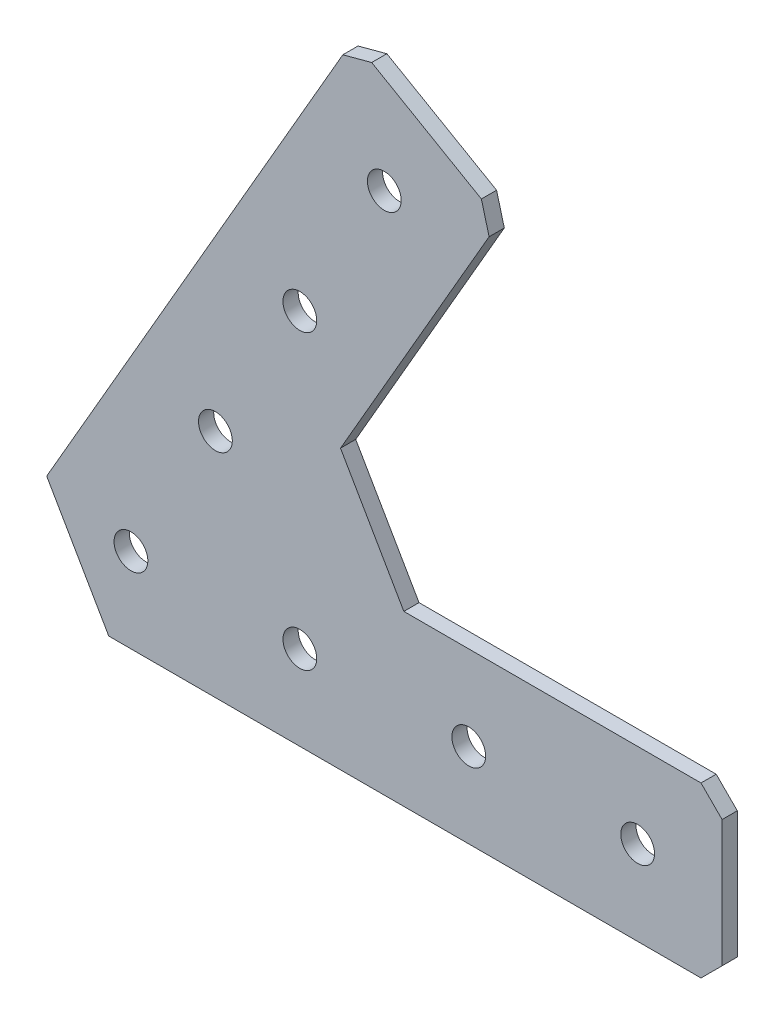
ISO-10303-21;
HEADER;
FILE_DESCRIPTION(('STEP AP214'),'2;1');
FILE_NAME('part.step','',(''),(''),'','','');
FILE_SCHEMA(('AUTOMOTIVE_DESIGN { 1 0 10303 214 1 1 1 1 }'));
ENDSEC;
DATA;
#1=APPLICATION_CONTEXT('core data for automotive mechanical design processes');
#2=APPLICATION_PROTOCOL_DEFINITION('international standard','automotive_design',2000,#1);
#3=PRODUCT_CONTEXT('',#1,'mechanical');
#4=PRODUCT('Part','Part','',(#3));
#5=PRODUCT_RELATED_PRODUCT_CATEGORY('part','',(#4));
#6=PRODUCT_DEFINITION_FORMATION('','',#4);
#7=PRODUCT_DEFINITION_CONTEXT('part definition',#1,'design');
#8=PRODUCT_DEFINITION('design','',#6,#7);
#9=PRODUCT_DEFINITION_SHAPE('','',#8);
#10=(LENGTH_UNIT() NAMED_UNIT(*) SI_UNIT(.MILLI.,.METRE.));
#11=(NAMED_UNIT(*) PLANE_ANGLE_UNIT() SI_UNIT($,.RADIAN.));
#12=(NAMED_UNIT(*) SI_UNIT($,.STERADIAN.) SOLID_ANGLE_UNIT());
#13=UNCERTAINTY_MEASURE_WITH_UNIT(LENGTH_MEASURE(1.E-05),#10,'distance_accuracy_value','');
#14=(GEOMETRIC_REPRESENTATION_CONTEXT(3) GLOBAL_UNCERTAINTY_ASSIGNED_CONTEXT((#13)) GLOBAL_UNIT_ASSIGNED_CONTEXT((#10,
#11,#12)) REPRESENTATION_CONTEXT('',''));
#15=CARTESIAN_POINT('',(0.,0.,0.));
#16=DIRECTION('',(0.,0.,1.));
#17=DIRECTION('',(1.,0.,0.));
#18=AXIS2_PLACEMENT_3D('',#15,#16,#17);
#19=CARTESIAN_POINT('',(0.,0.,-2.032));
#20=DIRECTION('',(0.,0.,-1.));
#21=DIRECTION('',(-1.,0.,0.));
#22=AXIS2_PLACEMENT_3D('',#19,#20,#21);
#23=PLANE('',#22);
#24=DIRECTION('',(-1.,0.,0.));
#25=VECTOR('',#24,1.);
#26=CARTESIAN_POINT('',(0.258928574833119,12.7,-2.032));
#27=LINE('',#26,#25);
#28=CARTESIAN_POINT('',(44.9454651,12.7,-2.032));
#29=VERTEX_POINT('',#28);
#30=CARTESIAN_POINT('',(0.258928574833118,12.7,-2.032));
#31=VERTEX_POINT('',#30);
#32=EDGE_CURVE('E444',#29,#31,#27,.T.);
#33=ORIENTED_EDGE('',*,*,#32,.F.);
#34=DIRECTION('',(-0.70710678118655,0.707106781186545,0.));
#35=VECTOR('',#34,1.);
#36=CARTESIAN_POINT('',(44.9454651,12.7,-2.032));
#37=LINE('',#36,#35);
#38=CARTESIAN_POINT('',(48.1204651,9.525,-2.032));
#39=VERTEX_POINT('',#38);
#40=EDGE_CURVE('E440',#39,#29,#37,.T.);
#41=ORIENTED_EDGE('',*,*,#40,.F.);
#42=DIRECTION('',(0.,1.,0.));
#43=VECTOR('',#42,1.);
#44=CARTESIAN_POINT('',(48.1204651,9.525,-2.032));
#45=LINE('',#44,#43);
#46=CARTESIAN_POINT('',(48.1204651,-9.52500000000001,-2.032));
#47=VERTEX_POINT('',#46);
#48=EDGE_CURVE('E123',#47,#39,#45,.T.);
#49=ORIENTED_EDGE('',*,*,#48,.F.);
#50=DIRECTION('',(0.707106781186548,0.707106781186548,0.));
#51=VECTOR('',#50,1.);
#52=CARTESIAN_POINT('',(48.1204651,-9.52500000000002,-2.032));
#53=LINE('',#52,#51);
#54=CARTESIAN_POINT('',(44.9454651,-12.7,-2.032));
#55=VERTEX_POINT('',#54);
#56=EDGE_CURVE('E117',#55,#47,#53,.T.);
#57=ORIENTED_EDGE('',*,*,#56,.F.);
#58=DIRECTION('',(1.,0.,0.));
#59=VECTOR('',#58,1.);
#60=CARTESIAN_POINT('',(44.9454651,-12.7,-2.032));
#61=LINE('',#60,#59);
#62=CARTESIAN_POINT('',(-44.1161619374166,-12.7,-2.032));
#63=VERTEX_POINT('',#62);
#64=EDGE_CURVE('E108',#63,#55,#61,.T.);
#65=ORIENTED_EDGE('',*,*,#64,.F.);
#66=DIRECTION('',(0.500000000000001,-0.866025403784438,0.));
#67=VECTOR('',#66,1.);
#68=CARTESIAN_POINT('',(-44.1161619374166,-12.7,-2.032));
#69=LINE('',#68,#67);
#70=CARTESIAN_POINT('',(-53.4506619374166,3.46782826325159,-2.032));
#71=VERTEX_POINT('',#70);
#72=EDGE_CURVE('E103',#71,#63,#69,.T.);
#73=ORIENTED_EDGE('',*,*,#72,.F.);
#74=DIRECTION('',(-0.500000000000004,-0.866025403784436,0.));
#75=VECTOR('',#74,1.);
#76=CARTESIAN_POINT('',(-53.4506619374166,3.46782826325159,-2.032));
#77=LINE('',#76,#75);
#78=CARTESIAN_POINT('',(-8.91556509999972,80.6048787056569,-2.032));
#79=VERTEX_POINT('',#78);
#80=EDGE_CURVE('E467',#79,#71,#77,.T.);
#81=ORIENTED_EDGE('',*,*,#80,.F.);
#82=DIRECTION('',(-0.965925826289069,-0.258819045102519,0.));
#83=VECTOR('',#82,1.);
#84=CARTESIAN_POINT('',(-8.91556509999973,80.6048787056569,-2.032));
#85=LINE('',#84,#83);
#86=CARTESIAN_POINT('',(-4.57843444298411,81.7670093626725,-2.032));
#87=VERTEX_POINT('',#86);
#88=EDGE_CURVE('E464',#87,#79,#85,.T.);
#89=ORIENTED_EDGE('',*,*,#88,.F.);
#90=DIRECTION('',(-0.866025403784437,0.500000000000003,0.));
#91=VECTOR('',#90,1.);
#92=CARTESIAN_POINT('',(-4.57843444298411,81.7670093626725,-2.032));
#93=LINE('',#92,#91);
#94=CARTESIAN_POINT('',(11.9193494991094,72.2420093626724,-2.032));
#95=VERTEX_POINT('',#94);
#96=EDGE_CURVE('E460',#95,#87,#93,.T.);
#97=ORIENTED_EDGE('',*,*,#96,.F.);
#98=DIRECTION('',(-0.258819045102517,0.965925826289069,0.));
#99=VECTOR('',#98,1.);
#100=CARTESIAN_POINT('',(11.9193494991094,72.2420093626724,-2.032));
#101=LINE('',#100,#99);
#102=CARTESIAN_POINT('',(13.081480156125,67.9048787056568,-2.032));
#103=VERTEX_POINT('',#102);
#104=EDGE_CURVE('E456',#103,#95,#101,.T.);
#105=ORIENTED_EDGE('',*,*,#104,.F.);
#106=DIRECTION('',(0.500000000000004,0.866025403784436,0.));
#107=VECTOR('',#106,1.);
#108=CARTESIAN_POINT('',(13.081480156125,67.9048787056568,-2.032));
#109=LINE('',#108,#107);
#110=CARTESIAN_POINT('',(-9.26607142516689,29.1977839420935,-2.032));
#111=VERTEX_POINT('',#110);
#112=EDGE_CURVE('E452',#111,#103,#109,.T.);
#113=ORIENTED_EDGE('',*,*,#112,.F.);
#114=DIRECTION('',(-0.500000000000002,0.866025403784438,0.));
#115=VECTOR('',#114,1.);
#116=CARTESIAN_POINT('',(-9.26607142516689,29.1977839420935,-2.032));
#117=LINE('',#116,#115);
#118=EDGE_CURVE('E448',#31,#111,#117,.T.);
#119=ORIENTED_EDGE('',*,*,#118,.F.);
#120=EDGE_LOOP('',(#33,#41,#49,#57,#65,#73,#81,#89,#97,#105,#113,#119));
#121=FACE_BOUND('',#120,.T.);
#122=CARTESIAN_POINT('',(-2.67954247193765,66.0059867346102,-2.032));
#123=DIRECTION('',(0.,0.,-1.));
#124=DIRECTION('',(-1.,0.,0.));
#125=AXIS2_PLACEMENT_3D('',#122,#123,#124);
#126=CIRCLE('',#125,2.53999999999999);
#127=CARTESIAN_POINT('',(-5.21954247193763,66.0059867346102,-2.032));
#128=VERTEX_POINT('',#127);
#129=EDGE_CURVE('E127',#128,#128,#126,.F.);
#130=ORIENTED_EDGE('',*,*,#129,.T.);
#131=EDGE_LOOP('',(#130));
#132=FACE_BOUND('',#131,.T.);
#133=CARTESIAN_POINT('',(-15.3795424719377,44.0089414784855,-2.032));
#134=DIRECTION('',(0.,0.,-1.));
#135=DIRECTION('',(-1.,0.,0.));
#136=AXIS2_PLACEMENT_3D('',#133,#134,#135);
#137=CIRCLE('',#136,2.53999999999999);
#138=CARTESIAN_POINT('',(-17.9195424719377,44.0089414784855,-2.032));
#139=VERTEX_POINT('',#138);
#140=EDGE_CURVE('E160',#139,#139,#137,.F.);
#141=ORIENTED_EDGE('',*,*,#140,.T.);
#142=EDGE_LOOP('',(#141));
#143=FACE_BOUND('',#142,.T.);
#144=CARTESIAN_POINT('',(-28.0795424719378,22.0118962223608,-2.032));
#145=DIRECTION('',(0.,0.,-1.));
#146=DIRECTION('',(-1.,0.,0.));
#147=AXIS2_PLACEMENT_3D('',#144,#145,#146);
#148=CIRCLE('',#147,2.53999999999999);
#149=CARTESIAN_POINT('',(-30.6195424719378,22.0118962223608,-2.032));
#150=VERTEX_POINT('',#149);
#151=EDGE_CURVE('E163',#150,#150,#148,.F.);
#152=ORIENTED_EDGE('',*,*,#151,.T.);
#153=EDGE_LOOP('',(#152));
#154=FACE_BOUND('',#153,.T.);
#155=CARTESIAN_POINT('',(-40.7795424719379,0.0148509662361157,-2.032));
#156=DIRECTION('',(0.,0.,-1.));
#157=DIRECTION('',(-1.,0.,0.));
#158=AXIS2_PLACEMENT_3D('',#155,#156,#157);
#159=CIRCLE('',#158,2.53999999999999);
#160=CARTESIAN_POINT('',(-43.3195424719379,0.0148509662361157,-2.032));
#161=VERTEX_POINT('',#160);
#162=EDGE_CURVE('E166',#161,#161,#159,.F.);
#163=ORIENTED_EDGE('',*,*,#162,.T.);
#164=EDGE_LOOP('',(#163));
#165=FACE_BOUND('',#164,.T.);
#166=CARTESIAN_POINT('',(35.4204651,0.,-2.032));
#167=DIRECTION('',(0.,0.,-1.));
#168=DIRECTION('',(-1.,0.,0.));
#169=AXIS2_PLACEMENT_3D('',#166,#167,#168);
#170=CIRCLE('',#169,2.54);
#171=CARTESIAN_POINT('',(32.8804651,0.,-2.032));
#172=VERTEX_POINT('',#171);
#173=EDGE_CURVE('E169',#172,#172,#170,.F.);
#174=ORIENTED_EDGE('',*,*,#173,.T.);
#175=EDGE_LOOP('',(#174));
#176=FACE_BOUND('',#175,.T.);
#177=CARTESIAN_POINT('',(10.0204651,0.,-2.032));
#178=DIRECTION('',(0.,0.,-1.));
#179=DIRECTION('',(-1.,0.,0.));
#180=AXIS2_PLACEMENT_3D('',#177,#178,#179);
#181=CIRCLE('',#180,2.54);
#182=CARTESIAN_POINT('',(7.48046509999999,0.,-2.032));
#183=VERTEX_POINT('',#182);
#184=EDGE_CURVE('E171',#183,#183,#181,.F.);
#185=ORIENTED_EDGE('',*,*,#184,.T.);
#186=EDGE_LOOP('',(#185));
#187=FACE_BOUND('',#186,.T.);
#188=CARTESIAN_POINT('',(-15.3795349,0.,-2.032));
#189=DIRECTION('',(0.,0.,-1.));
#190=DIRECTION('',(-1.,0.,0.));
#191=AXIS2_PLACEMENT_3D('',#188,#189,#190);
#192=CIRCLE('',#191,2.54);
#193=CARTESIAN_POINT('',(-17.9195349,0.,-2.032));
#194=VERTEX_POINT('',#193);
#195=EDGE_CURVE('E21',#194,#194,#192,.F.);
#196=ORIENTED_EDGE('',*,*,#195,.T.);
#197=EDGE_LOOP('',(#196));
#198=FACE_BOUND('',#197,.T.);
#199=ADVANCED_FACE('F18',(#121,#132,#143,#154,#165,#176,#187,#198),#23,.T.);
#200=CARTESIAN_POINT('',(-15.3795349,0.,0.254));
#201=DIRECTION('',(0.,0.,-1.));
#202=DIRECTION('',(-1.,0.,0.));
#203=AXIS2_PLACEMENT_3D('',#200,#201,#202);
#204=CYLINDRICAL_SURFACE('',#203,2.54);
#205=CARTESIAN_POINT('',(-15.3795349,0.,0.254));
#206=DIRECTION('',(0.,0.,-1.));
#207=DIRECTION('',(-1.,0.,0.));
#208=AXIS2_PLACEMENT_3D('',#205,#206,#207);
#209=CIRCLE('',#208,2.54);
#210=CARTESIAN_POINT('',(-17.9195349,0.,0.254));
#211=VERTEX_POINT('',#210);
#212=EDGE_CURVE('E154',#211,#211,#209,.F.);
#213=ORIENTED_EDGE('',*,*,#212,.T.);
#214=EDGE_LOOP('',(#213));
#215=FACE_BOUND('',#214,.T.);
#216=ORIENTED_EDGE('',*,*,#195,.F.);
#217=EDGE_LOOP('',(#216));
#218=FACE_BOUND('',#217,.T.);
#219=ADVANCED_FACE('F179',(#215,#218),#204,.F.);
#220=CARTESIAN_POINT('',(10.0204651,0.,0.254));
#221=DIRECTION('',(0.,0.,-1.));
#222=DIRECTION('',(-1.,0.,0.));
#223=AXIS2_PLACEMENT_3D('',#220,#221,#222);
#224=CYLINDRICAL_SURFACE('',#223,2.54);
#225=CARTESIAN_POINT('',(10.0204651,0.,0.254));
#226=DIRECTION('',(0.,0.,-1.));
#227=DIRECTION('',(-1.,0.,0.));
#228=AXIS2_PLACEMENT_3D('',#225,#226,#227);
#229=CIRCLE('',#228,2.54);
#230=CARTESIAN_POINT('',(7.48046509999999,0.,0.254));
#231=VERTEX_POINT('',#230);
#232=EDGE_CURVE('E151',#231,#231,#229,.F.);
#233=ORIENTED_EDGE('',*,*,#232,.T.);
#234=EDGE_LOOP('',(#233));
#235=FACE_BOUND('',#234,.T.);
#236=ORIENTED_EDGE('',*,*,#184,.F.);
#237=EDGE_LOOP('',(#236));
#238=FACE_BOUND('',#237,.T.);
#239=ADVANCED_FACE('F181',(#235,#238),#224,.F.);
#240=CARTESIAN_POINT('',(35.4204651,0.,0.254));
#241=DIRECTION('',(0.,0.,-1.));
#242=DIRECTION('',(-1.,0.,0.));
#243=AXIS2_PLACEMENT_3D('',#240,#241,#242);
#244=CYLINDRICAL_SURFACE('',#243,2.54);
#245=CARTESIAN_POINT('',(35.4204651,0.,0.254));
#246=DIRECTION('',(0.,0.,-1.));
#247=DIRECTION('',(-1.,0.,0.));
#248=AXIS2_PLACEMENT_3D('',#245,#246,#247);
#249=CIRCLE('',#248,2.54);
#250=CARTESIAN_POINT('',(32.8804651,0.,0.254));
#251=VERTEX_POINT('',#250);
#252=EDGE_CURVE('E148',#251,#251,#249,.F.);
#253=ORIENTED_EDGE('',*,*,#252,.T.);
#254=EDGE_LOOP('',(#253));
#255=FACE_BOUND('',#254,.T.);
#256=ORIENTED_EDGE('',*,*,#173,.F.);
#257=EDGE_LOOP('',(#256));
#258=FACE_BOUND('',#257,.T.);
#259=ADVANCED_FACE('F188',(#255,#258),#244,.F.);
#260=CARTESIAN_POINT('',(-40.7795424719379,0.0148509662361157,0.254));
#261=DIRECTION('',(0.,0.,-1.));
#262=DIRECTION('',(-1.,0.,0.));
#263=AXIS2_PLACEMENT_3D('',#260,#261,#262);
#264=CYLINDRICAL_SURFACE('',#263,2.53999999999999);
#265=CARTESIAN_POINT('',(-40.7795424719379,0.0148509662361157,0.254));
#266=DIRECTION('',(0.,0.,-1.));
#267=DIRECTION('',(-1.,0.,0.));
#268=AXIS2_PLACEMENT_3D('',#265,#266,#267);
#269=CIRCLE('',#268,2.53999999999999);
#270=CARTESIAN_POINT('',(-43.3195424719379,0.0148509662361157,0.254));
#271=VERTEX_POINT('',#270);
#272=EDGE_CURVE('E145',#271,#271,#269,.F.);
#273=ORIENTED_EDGE('',*,*,#272,.T.);
#274=EDGE_LOOP('',(#273));
#275=FACE_BOUND('',#274,.T.);
#276=ORIENTED_EDGE('',*,*,#162,.F.);
#277=EDGE_LOOP('',(#276));
#278=FACE_BOUND('',#277,.T.);
#279=ADVANCED_FACE('F253',(#275,#278),#264,.F.);
#280=CARTESIAN_POINT('',(-28.0795424719378,22.0118962223608,0.254));
#281=DIRECTION('',(0.,0.,-1.));
#282=DIRECTION('',(-1.,0.,0.));
#283=AXIS2_PLACEMENT_3D('',#280,#281,#282);
#284=CYLINDRICAL_SURFACE('',#283,2.53999999999999);
#285=CARTESIAN_POINT('',(-28.0795424719378,22.0118962223608,0.254));
#286=DIRECTION('',(0.,0.,-1.));
#287=DIRECTION('',(-1.,0.,0.));
#288=AXIS2_PLACEMENT_3D('',#285,#286,#287);
#289=CIRCLE('',#288,2.53999999999999);
#290=CARTESIAN_POINT('',(-30.6195424719378,22.0118962223608,0.254));
#291=VERTEX_POINT('',#290);
#292=EDGE_CURVE('E142',#291,#291,#289,.F.);
#293=ORIENTED_EDGE('',*,*,#292,.T.);
#294=EDGE_LOOP('',(#293));
#295=FACE_BOUND('',#294,.T.);
#296=ORIENTED_EDGE('',*,*,#151,.F.);
#297=EDGE_LOOP('',(#296));
#298=FACE_BOUND('',#297,.T.);
#299=ADVANCED_FACE('F249',(#295,#298),#284,.F.);
#300=CARTESIAN_POINT('',(-15.3795424719377,44.0089414784855,0.254));
#301=DIRECTION('',(0.,0.,-1.));
#302=DIRECTION('',(-1.,0.,0.));
#303=AXIS2_PLACEMENT_3D('',#300,#301,#302);
#304=CYLINDRICAL_SURFACE('',#303,2.53999999999999);
#305=CARTESIAN_POINT('',(-15.3795424719377,44.0089414784855,0.254));
#306=DIRECTION('',(0.,0.,-1.));
#307=DIRECTION('',(-1.,0.,0.));
#308=AXIS2_PLACEMENT_3D('',#305,#306,#307);
#309=CIRCLE('',#308,2.53999999999999);
#310=CARTESIAN_POINT('',(-17.9195424719377,44.0089414784855,0.254));
#311=VERTEX_POINT('',#310);
#312=EDGE_CURVE('E139',#311,#311,#309,.F.);
#313=ORIENTED_EDGE('',*,*,#312,.T.);
#314=EDGE_LOOP('',(#313));
#315=FACE_BOUND('',#314,.T.);
#316=ORIENTED_EDGE('',*,*,#140,.F.);
#317=EDGE_LOOP('',(#316));
#318=FACE_BOUND('',#317,.T.);
#319=ADVANCED_FACE('F245',(#315,#318),#304,.F.);
#320=CARTESIAN_POINT('',(-2.67954247193765,66.0059867346102,0.254));
#321=DIRECTION('',(0.,0.,-1.));
#322=DIRECTION('',(-1.,0.,0.));
#323=AXIS2_PLACEMENT_3D('',#320,#321,#322);
#324=CYLINDRICAL_SURFACE('',#323,2.53999999999999);
#325=CARTESIAN_POINT('',(-2.67954247193765,66.0059867346102,0.254));
#326=DIRECTION('',(0.,0.,-1.));
#327=DIRECTION('',(-1.,0.,0.));
#328=AXIS2_PLACEMENT_3D('',#325,#326,#327);
#329=CIRCLE('',#328,2.53999999999999);
#330=CARTESIAN_POINT('',(-5.21954247193763,66.0059867346102,0.254));
#331=VERTEX_POINT('',#330);
#332=EDGE_CURVE('E136',#331,#331,#329,.F.);
#333=ORIENTED_EDGE('',*,*,#332,.T.);
#334=EDGE_LOOP('',(#333));
#335=FACE_BOUND('',#334,.T.);
#336=ORIENTED_EDGE('',*,*,#129,.F.);
#337=EDGE_LOOP('',(#336));
#338=FACE_BOUND('',#337,.T.);
#339=ADVANCED_FACE('F242',(#335,#338),#324,.F.);
#340=CARTESIAN_POINT('',(48.1204651,-9.52500000000002,0.254));
#341=DIRECTION('',(0.707106781186548,-0.707106781186548,0.));
#342=DIRECTION('',(0.707106781186548,0.707106781186548,0.));
#343=AXIS2_PLACEMENT_3D('',#340,#341,#342);
#344=PLANE('',#343);
#345=DIRECTION('',(-0.707106781186548,-0.707106781186548,0.));
#346=VECTOR('',#345,1.);
#347=CARTESIAN_POINT('',(48.1204651,-9.52500000000002,0.254));
#348=LINE('',#347,#346);
#349=CARTESIAN_POINT('',(48.1204651,-9.52500000000002,0.254));
#350=VERTEX_POINT('',#349);
#351=CARTESIAN_POINT('',(44.9454651,-12.7,0.254));
#352=VERTEX_POINT('',#351);
#353=EDGE_CURVE('E131',#350,#352,#348,.T.);
#354=ORIENTED_EDGE('',*,*,#353,.T.);
#355=DIRECTION('',(0.,0.,-1.));
#356=VECTOR('',#355,1.);
#357=CARTESIAN_POINT('',(44.9454651,-12.7,0.254));
#358=LINE('',#357,#356);
#359=EDGE_CURVE('E113',#55,#352,#358,.F.);
#360=ORIENTED_EDGE('',*,*,#359,.F.);
#361=ORIENTED_EDGE('',*,*,#56,.T.);
#362=DIRECTION('',(0.,0.,-1.));
#363=VECTOR('',#362,1.);
#364=CARTESIAN_POINT('',(48.1204651,-9.52500000000002,0.254));
#365=LINE('',#364,#363);
#366=EDGE_CURVE('E157',#350,#47,#365,.T.);
#367=ORIENTED_EDGE('',*,*,#366,.F.);
#368=EDGE_LOOP('',(#354,#360,#361,#367));
#369=FACE_BOUND('',#368,.T.);
#370=ADVANCED_FACE('F130',(#369),#344,.T.);
#371=CARTESIAN_POINT('',(44.9454651,-12.7,0.254));
#372=DIRECTION('',(0.,-1.,0.));
#373=DIRECTION('',(0.,0.,-1.));
#374=AXIS2_PLACEMENT_3D('',#371,#372,#373);
#375=PLANE('',#374);
#376=DIRECTION('',(-1.,0.,0.));
#377=VECTOR('',#376,1.);
#378=CARTESIAN_POINT('',(0.,-12.7,0.254));
#379=LINE('',#378,#377);
#380=CARTESIAN_POINT('',(-44.1161619374166,-12.7,0.254));
#381=VERTEX_POINT('',#380);
#382=EDGE_CURVE('E426',#352,#381,#379,.T.);
#383=ORIENTED_EDGE('',*,*,#382,.T.);
#384=DIRECTION('',(0.,0.,1.));
#385=VECTOR('',#384,1.);
#386=CARTESIAN_POINT('',(-44.1161619374166,-12.7,0.254));
#387=LINE('',#386,#385);
#388=EDGE_CURVE('E115',#63,#381,#387,.T.);
#389=ORIENTED_EDGE('',*,*,#388,.F.);
#390=ORIENTED_EDGE('',*,*,#64,.T.);
#391=ORIENTED_EDGE('',*,*,#359,.T.);
#392=EDGE_LOOP('',(#383,#389,#390,#391));
#393=FACE_BOUND('',#392,.T.);
#394=ADVANCED_FACE('F111',(#393),#375,.T.);
#395=CARTESIAN_POINT('',(-44.1161619374166,-12.7,0.254));
#396=DIRECTION('',(-0.866025403784438,-0.500000000000001,0.));
#397=DIRECTION('',(0.500000000000001,-0.866025403784438,0.));
#398=AXIS2_PLACEMENT_3D('',#395,#396,#397);
#399=PLANE('',#398);
#400=DIRECTION('',(-0.500000000000002,0.866025403784438,0.));
#401=VECTOR('',#400,1.);
#402=CARTESIAN_POINT('',(-44.1161619374166,-12.7,0.254));
#403=LINE('',#402,#401);
#404=CARTESIAN_POINT('',(-53.4506619374166,3.46782826325159,0.254));
#405=VERTEX_POINT('',#404);
#406=EDGE_CURVE('E422',#381,#405,#403,.T.);
#407=ORIENTED_EDGE('',*,*,#406,.T.);
#408=DIRECTION('',(0.,0.,1.));
#409=VECTOR('',#408,1.);
#410=CARTESIAN_POINT('',(-53.4506619374166,3.46782826325159,0.254));
#411=LINE('',#410,#409);
#412=EDGE_CURVE('E423',#71,#405,#411,.T.);
#413=ORIENTED_EDGE('',*,*,#412,.F.);
#414=ORIENTED_EDGE('',*,*,#72,.T.);
#415=ORIENTED_EDGE('',*,*,#388,.T.);
#416=EDGE_LOOP('',(#407,#413,#414,#415));
#417=FACE_BOUND('',#416,.T.);
#418=ADVANCED_FACE('F234',(#417),#399,.T.);
#419=CARTESIAN_POINT('',(-53.4506619374166,3.46782826325159,0.254));
#420=DIRECTION('',(-0.866025403784436,0.500000000000004,0.));
#421=DIRECTION('',(-0.500000000000004,-0.866025403784436,0.));
#422=AXIS2_PLACEMENT_3D('',#419,#420,#421);
#423=PLANE('',#422);
#424=DIRECTION('',(0.500000000000004,0.866025403784437,0.));
#425=VECTOR('',#424,1.);
#426=CARTESIAN_POINT('',(-53.4506619374166,3.46782826325159,0.254));
#427=LINE('',#426,#425);
#428=CARTESIAN_POINT('',(-8.91556509999972,80.6048787056569,0.254));
#429=VERTEX_POINT('',#428);
#430=EDGE_CURVE('E425',#405,#429,#427,.T.);
#431=ORIENTED_EDGE('',*,*,#430,.T.);
#432=DIRECTION('',(0.,0.,1.));
#433=VECTOR('',#432,1.);
#434=CARTESIAN_POINT('',(-8.91556509999973,80.6048787056569,0.254));
#435=LINE('',#434,#433);
#436=EDGE_CURVE('E462',#79,#429,#435,.T.);
#437=ORIENTED_EDGE('',*,*,#436,.F.);
#438=ORIENTED_EDGE('',*,*,#80,.T.);
#439=ORIENTED_EDGE('',*,*,#412,.T.);
#440=EDGE_LOOP('',(#431,#437,#438,#439));
#441=FACE_BOUND('',#440,.T.);
#442=ADVANCED_FACE('F230',(#441),#423,.T.);
#443=CARTESIAN_POINT('',(-8.91556509999973,80.6048787056569,0.254));
#444=DIRECTION('',(-0.258819045102519,0.965925826289069,0.));
#445=DIRECTION('',(-0.965925826289069,-0.258819045102519,0.));
#446=AXIS2_PLACEMENT_3D('',#443,#444,#445);
#447=PLANE('',#446);
#448=DIRECTION('',(0.965925826289069,0.258819045102519,0.));
#449=VECTOR('',#448,1.);
#450=CARTESIAN_POINT('',(-8.91556509999973,80.6048787056569,0.254));
#451=LINE('',#450,#449);
#452=CARTESIAN_POINT('',(-4.57843444298411,81.7670093626725,0.254));
#453=VERTEX_POINT('',#452);
#454=EDGE_CURVE('E429',#429,#453,#451,.T.);
#455=ORIENTED_EDGE('',*,*,#454,.T.);
#456=DIRECTION('',(0.,0.,1.));
#457=VECTOR('',#456,1.);
#458=CARTESIAN_POINT('',(-4.57843444298411,81.7670093626725,0.254));
#459=LINE('',#458,#457);
#460=EDGE_CURVE('E458',#87,#453,#459,.T.);
#461=ORIENTED_EDGE('',*,*,#460,.F.);
#462=ORIENTED_EDGE('',*,*,#88,.T.);
#463=ORIENTED_EDGE('',*,*,#436,.T.);
#464=EDGE_LOOP('',(#455,#461,#462,#463));
#465=FACE_BOUND('',#464,.T.);
#466=ADVANCED_FACE('F226',(#465),#447,.T.);
#467=CARTESIAN_POINT('',(-4.57843444298411,81.7670093626725,0.254));
#468=DIRECTION('',(0.500000000000003,0.866025403784437,0.));
#469=DIRECTION('',(-0.866025403784437,0.500000000000003,0.));
#470=AXIS2_PLACEMENT_3D('',#467,#468,#469);
#471=PLANE('',#470);
#472=DIRECTION('',(0.866025403784437,-0.500000000000003,0.));
#473=VECTOR('',#472,1.);
#474=CARTESIAN_POINT('',(-4.57843444298411,81.7670093626725,0.254));
#475=LINE('',#474,#473);
#476=CARTESIAN_POINT('',(11.9193494991094,72.2420093626724,0.254));
#477=VERTEX_POINT('',#476);
#478=EDGE_CURVE('E479',#453,#477,#475,.T.);
#479=ORIENTED_EDGE('',*,*,#478,.T.);
#480=DIRECTION('',(0.,0.,1.));
#481=VECTOR('',#480,1.);
#482=CARTESIAN_POINT('',(11.9193494991094,72.2420093626724,0.254));
#483=LINE('',#482,#481);
#484=EDGE_CURVE('E454',#95,#477,#483,.T.);
#485=ORIENTED_EDGE('',*,*,#484,.F.);
#486=ORIENTED_EDGE('',*,*,#96,.T.);
#487=ORIENTED_EDGE('',*,*,#460,.T.);
#488=EDGE_LOOP('',(#479,#485,#486,#487));
#489=FACE_BOUND('',#488,.T.);
#490=ADVANCED_FACE('F222',(#489),#471,.T.);
#491=CARTESIAN_POINT('',(11.9193494991094,72.2420093626724,0.254));
#492=DIRECTION('',(0.965925826289069,0.258819045102517,0.));
#493=DIRECTION('',(-0.258819045102517,0.965925826289069,0.));
#494=AXIS2_PLACEMENT_3D('',#491,#492,#493);
#495=PLANE('',#494);
#496=DIRECTION('',(0.258819045102517,-0.965925826289069,0.));
#497=VECTOR('',#496,1.);
#498=CARTESIAN_POINT('',(11.9193494991094,72.2420093626724,0.254));
#499=LINE('',#498,#497);
#500=CARTESIAN_POINT('',(13.081480156125,67.9048787056568,0.254));
#501=VERTEX_POINT('',#500);
#502=EDGE_CURVE('E483',#477,#501,#499,.T.);
#503=ORIENTED_EDGE('',*,*,#502,.T.);
#504=DIRECTION('',(0.,0.,1.));
#505=VECTOR('',#504,1.);
#506=CARTESIAN_POINT('',(13.081480156125,67.9048787056568,0.254));
#507=LINE('',#506,#505);
#508=EDGE_CURVE('E450',#103,#501,#507,.T.);
#509=ORIENTED_EDGE('',*,*,#508,.F.);
#510=ORIENTED_EDGE('',*,*,#104,.T.);
#511=ORIENTED_EDGE('',*,*,#484,.T.);
#512=EDGE_LOOP('',(#503,#509,#510,#511));
#513=FACE_BOUND('',#512,.T.);
#514=ADVANCED_FACE('F218',(#513),#495,.T.);
#515=CARTESIAN_POINT('',(13.081480156125,67.9048787056568,0.254));
#516=DIRECTION('',(0.866025403784436,-0.500000000000004,0.));
#517=DIRECTION('',(0.500000000000004,0.866025403784436,0.));
#518=AXIS2_PLACEMENT_3D('',#515,#516,#517);
#519=PLANE('',#518);
#520=DIRECTION('',(-0.500000000000004,-0.866025403784436,0.));
#521=VECTOR('',#520,1.);
#522=CARTESIAN_POINT('',(13.081480156125,67.9048787056568,0.254));
#523=LINE('',#522,#521);
#524=CARTESIAN_POINT('',(-9.26607142516689,29.1977839420935,0.254));
#525=VERTEX_POINT('',#524);
#526=EDGE_CURVE('E485',#501,#525,#523,.T.);
#527=ORIENTED_EDGE('',*,*,#526,.T.);
#528=DIRECTION('',(0.,0.,1.));
#529=VECTOR('',#528,1.);
#530=CARTESIAN_POINT('',(-9.26607142516689,29.1977839420935,0.254));
#531=LINE('',#530,#529);
#532=EDGE_CURVE('E446',#111,#525,#531,.T.);
#533=ORIENTED_EDGE('',*,*,#532,.F.);
#534=ORIENTED_EDGE('',*,*,#112,.T.);
#535=ORIENTED_EDGE('',*,*,#508,.T.);
#536=EDGE_LOOP('',(#527,#533,#534,#535));
#537=FACE_BOUND('',#536,.T.);
#538=ADVANCED_FACE('F214',(#537),#519,.T.);
#539=CARTESIAN_POINT('',(-9.26607142516689,29.1977839420935,0.254));
#540=DIRECTION('',(0.866025403784438,0.500000000000002,0.));
#541=DIRECTION('',(-0.500000000000002,0.866025403784438,0.));
#542=AXIS2_PLACEMENT_3D('',#539,#540,#541);
#543=PLANE('',#542);
#544=DIRECTION('',(0.500000000000001,-0.866025403784438,0.));
#545=VECTOR('',#544,1.);
#546=CARTESIAN_POINT('',(-9.26607142516689,29.1977839420935,0.254));
#547=LINE('',#546,#545);
#548=CARTESIAN_POINT('',(0.258928574833118,12.7,0.254));
#549=VERTEX_POINT('',#548);
#550=EDGE_CURVE('E490',#525,#549,#547,.T.);
#551=ORIENTED_EDGE('',*,*,#550,.T.);
#552=DIRECTION('',(0.,0.,1.));
#553=VECTOR('',#552,1.);
#554=CARTESIAN_POINT('',(0.258928574833119,12.7,0.254));
#555=LINE('',#554,#553);
#556=EDGE_CURVE('E442',#31,#549,#555,.T.);
#557=ORIENTED_EDGE('',*,*,#556,.F.);
#558=ORIENTED_EDGE('',*,*,#118,.T.);
#559=ORIENTED_EDGE('',*,*,#532,.T.);
#560=EDGE_LOOP('',(#551,#557,#558,#559));
#561=FACE_BOUND('',#560,.T.);
#562=ADVANCED_FACE('F210',(#561),#543,.T.);
#563=CARTESIAN_POINT('',(0.258928574833119,12.7,0.254));
#564=DIRECTION('',(0.,1.,0.));
#565=DIRECTION('',(-1.,0.,0.));
#566=AXIS2_PLACEMENT_3D('',#563,#564,#565);
#567=PLANE('',#566);
#568=DIRECTION('',(-1.,0.,0.));
#569=VECTOR('',#568,1.);
#570=CARTESIAN_POINT('',(0.,12.7,0.254));
#571=LINE('',#570,#569);
#572=CARTESIAN_POINT('',(44.9454651,12.7,0.254));
#573=VERTEX_POINT('',#572);
#574=EDGE_CURVE('E493',#549,#573,#571,.F.);
#575=ORIENTED_EDGE('',*,*,#574,.T.);
#576=DIRECTION('',(0.,0.,1.));
#577=VECTOR('',#576,1.);
#578=CARTESIAN_POINT('',(44.9454651,12.7,0.254));
#579=LINE('',#578,#577);
#580=EDGE_CURVE('E438',#29,#573,#579,.T.);
#581=ORIENTED_EDGE('',*,*,#580,.F.);
#582=ORIENTED_EDGE('',*,*,#32,.T.);
#583=ORIENTED_EDGE('',*,*,#556,.T.);
#584=EDGE_LOOP('',(#575,#581,#582,#583));
#585=FACE_BOUND('',#584,.T.);
#586=ADVANCED_FACE('F206',(#585),#567,.T.);
#587=CARTESIAN_POINT('',(44.9454651,12.7,0.254));
#588=DIRECTION('',(0.707106781186545,0.70710678118655,0.));
#589=DIRECTION('',(-0.70710678118655,0.707106781186545,0.));
#590=AXIS2_PLACEMENT_3D('',#587,#588,#589);
#591=PLANE('',#590);
#592=DIRECTION('',(0.707106781186549,-0.707106781186546,0.));
#593=VECTOR('',#592,1.);
#594=CARTESIAN_POINT('',(44.9454651,12.7,0.254));
#595=LINE('',#594,#593);
#596=CARTESIAN_POINT('',(48.1204651,9.525,0.254));
#597=VERTEX_POINT('',#596);
#598=EDGE_CURVE('E27',#573,#597,#595,.T.);
#599=ORIENTED_EDGE('',*,*,#598,.T.);
#600=DIRECTION('',(0.,0.,-1.));
#601=VECTOR('',#600,1.);
#602=CARTESIAN_POINT('',(48.1204651,9.525,0.254));
#603=LINE('',#602,#601);
#604=EDGE_CURVE('E35',#39,#597,#603,.F.);
#605=ORIENTED_EDGE('',*,*,#604,.F.);
#606=ORIENTED_EDGE('',*,*,#40,.T.);
#607=ORIENTED_EDGE('',*,*,#580,.T.);
#608=EDGE_LOOP('',(#599,#605,#606,#607));
#609=FACE_BOUND('',#608,.T.);
#610=ADVANCED_FACE('F199',(#609),#591,.T.);
#611=CARTESIAN_POINT('',(48.1204651,9.525,0.254));
#612=DIRECTION('',(1.,0.,0.));
#613=DIRECTION('',(0.,0.,-1.));
#614=AXIS2_PLACEMENT_3D('',#611,#612,#613);
#615=PLANE('',#614);
#616=DIRECTION('',(0.,1.,0.));
#617=VECTOR('',#616,1.);
#618=CARTESIAN_POINT('',(48.1204651,0.,0.254));
#619=LINE('',#618,#617);
#620=EDGE_CURVE('E11',#597,#350,#619,.F.);
#621=ORIENTED_EDGE('',*,*,#620,.T.);
#622=ORIENTED_EDGE('',*,*,#366,.T.);
#623=ORIENTED_EDGE('',*,*,#48,.T.);
#624=ORIENTED_EDGE('',*,*,#604,.T.);
#625=EDGE_LOOP('',(#621,#622,#623,#624));
#626=FACE_BOUND('',#625,.T.);
#627=ADVANCED_FACE('F193',(#626),#615,.T.);
#628=CARTESIAN_POINT('',(0.,0.,0.254));
#629=DIRECTION('',(0.,0.,-1.));
#630=DIRECTION('',(-1.,0.,0.));
#631=AXIS2_PLACEMENT_3D('',#628,#629,#630);
#632=PLANE('',#631);
#633=ORIENTED_EDGE('',*,*,#598,.F.);
#634=ORIENTED_EDGE('',*,*,#574,.F.);
#635=ORIENTED_EDGE('',*,*,#550,.F.);
#636=ORIENTED_EDGE('',*,*,#526,.F.);
#637=ORIENTED_EDGE('',*,*,#502,.F.);
#638=ORIENTED_EDGE('',*,*,#478,.F.);
#639=ORIENTED_EDGE('',*,*,#454,.F.);
#640=ORIENTED_EDGE('',*,*,#430,.F.);
#641=ORIENTED_EDGE('',*,*,#406,.F.);
#642=ORIENTED_EDGE('',*,*,#382,.F.);
#643=ORIENTED_EDGE('',*,*,#353,.F.);
#644=ORIENTED_EDGE('',*,*,#620,.F.);
#645=EDGE_LOOP('',(#633,#634,#635,#636,#637,#638,#639,#640,#641,#642,#643,#644));
#646=FACE_BOUND('',#645,.T.);
#647=ORIENTED_EDGE('',*,*,#332,.F.);
#648=EDGE_LOOP('',(#647));
#649=FACE_BOUND('',#648,.T.);
#650=ORIENTED_EDGE('',*,*,#312,.F.);
#651=EDGE_LOOP('',(#650));
#652=FACE_BOUND('',#651,.T.);
#653=ORIENTED_EDGE('',*,*,#292,.F.);
#654=EDGE_LOOP('',(#653));
#655=FACE_BOUND('',#654,.T.);
#656=ORIENTED_EDGE('',*,*,#272,.F.);
#657=EDGE_LOOP('',(#656));
#658=FACE_BOUND('',#657,.T.);
#659=ORIENTED_EDGE('',*,*,#252,.F.);
#660=EDGE_LOOP('',(#659));
#661=FACE_BOUND('',#660,.T.);
#662=ORIENTED_EDGE('',*,*,#232,.F.);
#663=EDGE_LOOP('',(#662));
#664=FACE_BOUND('',#663,.T.);
#665=ORIENTED_EDGE('',*,*,#212,.F.);
#666=EDGE_LOOP('',(#665));
#667=FACE_BOUND('',#666,.T.);
#668=ADVANCED_FACE('F191',(#646,#649,#652,#655,#658,#661,#664,#667),#632,.F.);
#669=CLOSED_SHELL('',(#199,#219,#239,#259,#279,#299,#319,#339,#370,#394,#418,#442,#466,#490,
#514,#538,#562,#586,#610,#627,#668));
#670=MANIFOLD_SOLID_BREP('B1',#669);
#671=ADVANCED_BREP_SHAPE_REPRESENTATION('',(#18,#670),#14);
#672=SHAPE_DEFINITION_REPRESENTATION(#9,#671);
ENDSEC;
END-ISO-10303-21;
